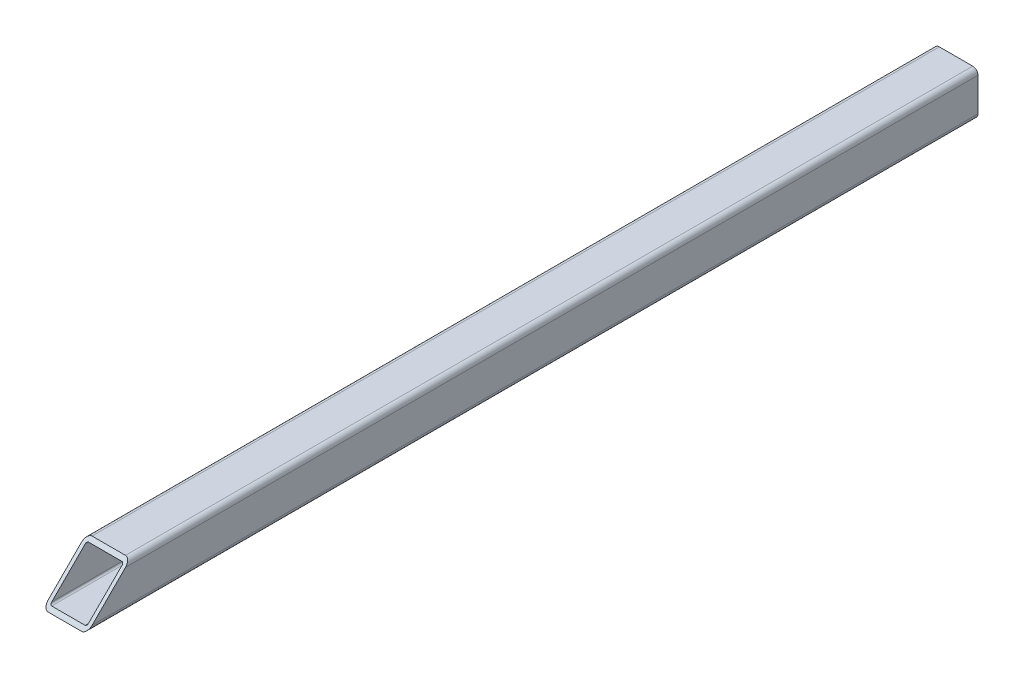
ISO-10303-21;
HEADER;
FILE_DESCRIPTION(('STEP AP214'),'2;1');
FILE_NAME('part.step','',(''),(''),'','','');
FILE_SCHEMA(('AUTOMOTIVE_DESIGN { 1 0 10303 214 1 1 1 1 }'));
ENDSEC;
DATA;
#1=APPLICATION_CONTEXT('core data for automotive mechanical design processes');
#2=APPLICATION_PROTOCOL_DEFINITION('international standard','automotive_design',2000,#1);
#3=PRODUCT_CONTEXT('',#1,'mechanical');
#4=PRODUCT('Part','Part','',(#3));
#5=PRODUCT_RELATED_PRODUCT_CATEGORY('part','',(#4));
#6=PRODUCT_DEFINITION_FORMATION('','',#4);
#7=PRODUCT_DEFINITION_CONTEXT('part definition',#1,'design');
#8=PRODUCT_DEFINITION('design','',#6,#7);
#9=PRODUCT_DEFINITION_SHAPE('','',#8);
#10=(LENGTH_UNIT() NAMED_UNIT(*) SI_UNIT(.MILLI.,.METRE.));
#11=(NAMED_UNIT(*) PLANE_ANGLE_UNIT() SI_UNIT($,.RADIAN.));
#12=(NAMED_UNIT(*) SI_UNIT($,.STERADIAN.) SOLID_ANGLE_UNIT());
#13=UNCERTAINTY_MEASURE_WITH_UNIT(LENGTH_MEASURE(1.E-05),#10,'distance_accuracy_value','');
#14=(GEOMETRIC_REPRESENTATION_CONTEXT(3) GLOBAL_UNCERTAINTY_ASSIGNED_CONTEXT((#13)) GLOBAL_UNIT_ASSIGNED_CONTEXT((#10,
#11,#12)) REPRESENTATION_CONTEXT('',''));
#15=CARTESIAN_POINT('',(0.,0.,0.));
#16=DIRECTION('',(0.,0.,1.));
#17=DIRECTION('',(1.,0.,0.));
#18=AXIS2_PLACEMENT_3D('',#15,#16,#17);
#19=CARTESIAN_POINT('',(0.,0.,0.));
#20=DIRECTION('',(0.,0.,1.));
#21=DIRECTION('',(1.,0.,0.));
#22=AXIS2_PLACEMENT_3D('',#19,#20,#21);
#23=PLANE('',#22);
#24=DIRECTION('',(0.,1.,0.));
#25=VECTOR('',#24,1.);
#26=CARTESIAN_POINT('',(-12.5,-4.75,0.));
#27=LINE('',#26,#25);
#28=CARTESIAN_POINT('',(-12.5,-9.5,0.));
#29=VERTEX_POINT('',#28);
#30=CARTESIAN_POINT('',(-12.5,9.5,0.));
#31=VERTEX_POINT('',#30);
#32=EDGE_CURVE('E131',#29,#31,#27,.T.);
#33=ORIENTED_EDGE('',*,*,#32,.T.);
#34=CARTESIAN_POINT('',(-9.5,9.5,0.));
#35=DIRECTION('',(0.,0.,-1.));
#36=DIRECTION('',(0.,-1.,0.));
#37=AXIS2_PLACEMENT_3D('',#34,#35,#36);
#38=CIRCLE('',#37,3.);
#39=CARTESIAN_POINT('',(-9.5,12.5,0.));
#40=VERTEX_POINT('',#39);
#41=EDGE_CURVE('E190',#31,#40,#38,.T.);
#42=ORIENTED_EDGE('',*,*,#41,.T.);
#43=DIRECTION('',(1.,0.,0.));
#44=VECTOR('',#43,1.);
#45=CARTESIAN_POINT('',(-4.75,12.5,0.));
#46=LINE('',#45,#44);
#47=CARTESIAN_POINT('',(9.5,12.5,0.));
#48=VERTEX_POINT('',#47);
#49=EDGE_CURVE('E97',#40,#48,#46,.T.);
#50=ORIENTED_EDGE('',*,*,#49,.T.);
#51=CARTESIAN_POINT('',(9.5,9.5,0.));
#52=DIRECTION('',(0.,0.,-1.));
#53=DIRECTION('',(-1.,0.,0.));
#54=AXIS2_PLACEMENT_3D('',#51,#52,#53);
#55=CIRCLE('',#54,3.);
#56=CARTESIAN_POINT('',(12.5,9.5,0.));
#57=VERTEX_POINT('',#56);
#58=EDGE_CURVE('E92',#48,#57,#55,.T.);
#59=ORIENTED_EDGE('',*,*,#58,.T.);
#60=DIRECTION('',(0.,-1.,0.));
#61=VECTOR('',#60,1.);
#62=CARTESIAN_POINT('',(12.5,4.75,0.));
#63=LINE('',#62,#61);
#64=CARTESIAN_POINT('',(12.5,-9.5,0.));
#65=VERTEX_POINT('',#64);
#66=EDGE_CURVE('E76',#57,#65,#63,.T.);
#67=ORIENTED_EDGE('',*,*,#66,.T.);
#68=CARTESIAN_POINT('',(9.5,-9.5,0.));
#69=DIRECTION('',(0.,0.,-1.));
#70=DIRECTION('',(0.,1.,0.));
#71=AXIS2_PLACEMENT_3D('',#68,#69,#70);
#72=CIRCLE('',#71,3.);
#73=CARTESIAN_POINT('',(9.5,-12.5,0.));
#74=VERTEX_POINT('',#73);
#75=EDGE_CURVE('E234',#65,#74,#72,.T.);
#76=ORIENTED_EDGE('',*,*,#75,.T.);
#77=DIRECTION('',(-1.,0.,0.));
#78=VECTOR('',#77,1.);
#79=CARTESIAN_POINT('',(4.75,-12.5,0.));
#80=LINE('',#79,#78);
#81=CARTESIAN_POINT('',(-9.5,-12.5,0.));
#82=VERTEX_POINT('',#81);
#83=EDGE_CURVE('E27',#74,#82,#80,.T.);
#84=ORIENTED_EDGE('',*,*,#83,.T.);
#85=CARTESIAN_POINT('',(-9.5,-9.5,0.));
#86=DIRECTION('',(0.,0.,-1.));
#87=DIRECTION('',(1.,0.,0.));
#88=AXIS2_PLACEMENT_3D('',#85,#86,#87);
#89=CIRCLE('',#88,3.);
#90=EDGE_CURVE('E11',#82,#29,#89,.T.);
#91=ORIENTED_EDGE('',*,*,#90,.T.);
#92=EDGE_LOOP('',(#33,#42,#50,#59,#67,#76,#84,#91));
#93=FACE_BOUND('',#92,.T.);
#94=DIRECTION('',(-1.,0.,0.));
#95=VECTOR('',#94,1.);
#96=CARTESIAN_POINT('',(-4.75,10.5,0.));
#97=LINE('',#96,#95);
#98=CARTESIAN_POINT('',(9.5,10.5,0.));
#99=VERTEX_POINT('',#98);
#100=CARTESIAN_POINT('',(-9.5,10.5,0.));
#101=VERTEX_POINT('',#100);
#102=EDGE_CURVE('E203',#99,#101,#97,.T.);
#103=ORIENTED_EDGE('',*,*,#102,.T.);
#104=CARTESIAN_POINT('',(-9.5,9.5,0.));
#105=DIRECTION('',(0.,0.,1.));
#106=DIRECTION('',(0.,-1.,0.));
#107=AXIS2_PLACEMENT_3D('',#104,#105,#106);
#108=CIRCLE('',#107,1.);
#109=CARTESIAN_POINT('',(-10.5,9.5,0.));
#110=VERTEX_POINT('',#109);
#111=EDGE_CURVE('E174',#101,#110,#108,.T.);
#112=ORIENTED_EDGE('',*,*,#111,.T.);
#113=DIRECTION('',(0.,-1.,0.));
#114=VECTOR('',#113,1.);
#115=CARTESIAN_POINT('',(-10.5,-4.75,0.));
#116=LINE('',#115,#114);
#117=CARTESIAN_POINT('',(-10.5,-9.5,0.));
#118=VERTEX_POINT('',#117);
#119=EDGE_CURVE('E158',#110,#118,#116,.T.);
#120=ORIENTED_EDGE('',*,*,#119,.T.);
#121=CARTESIAN_POINT('',(-9.5,-9.5,0.));
#122=DIRECTION('',(0.,0.,1.));
#123=DIRECTION('',(1.,0.,0.));
#124=AXIS2_PLACEMENT_3D('',#121,#122,#123);
#125=CIRCLE('',#124,1.);
#126=CARTESIAN_POINT('',(-9.5,-10.5,0.));
#127=VERTEX_POINT('',#126);
#128=EDGE_CURVE('E137',#118,#127,#125,.T.);
#129=ORIENTED_EDGE('',*,*,#128,.T.);
#130=DIRECTION('',(1.,0.,0.));
#131=VECTOR('',#130,1.);
#132=CARTESIAN_POINT('',(4.75,-10.5,0.));
#133=LINE('',#132,#131);
#134=CARTESIAN_POINT('',(9.5,-10.5,0.));
#135=VERTEX_POINT('',#134);
#136=EDGE_CURVE('E167',#127,#135,#133,.T.);
#137=ORIENTED_EDGE('',*,*,#136,.T.);
#138=CARTESIAN_POINT('',(9.5,-9.5,0.));
#139=DIRECTION('',(0.,0.,1.));
#140=DIRECTION('',(0.,1.,0.));
#141=AXIS2_PLACEMENT_3D('',#138,#139,#140);
#142=CIRCLE('',#141,1.);
#143=CARTESIAN_POINT('',(10.5,-9.5,0.));
#144=VERTEX_POINT('',#143);
#145=EDGE_CURVE('E166',#135,#144,#142,.T.);
#146=ORIENTED_EDGE('',*,*,#145,.T.);
#147=DIRECTION('',(0.,1.,0.));
#148=VECTOR('',#147,1.);
#149=CARTESIAN_POINT('',(10.5,4.75,0.));
#150=LINE('',#149,#148);
#151=CARTESIAN_POINT('',(10.5,9.5,0.));
#152=VERTEX_POINT('',#151);
#153=EDGE_CURVE('E317',#144,#152,#150,.T.);
#154=ORIENTED_EDGE('',*,*,#153,.T.);
#155=CARTESIAN_POINT('',(9.5,9.5,0.));
#156=DIRECTION('',(0.,0.,1.));
#157=DIRECTION('',(-1.,0.,0.));
#158=AXIS2_PLACEMENT_3D('',#155,#156,#157);
#159=CIRCLE('',#158,1.);
#160=EDGE_CURVE('E210',#152,#99,#159,.T.);
#161=ORIENTED_EDGE('',*,*,#160,.T.);
#162=EDGE_LOOP('',(#103,#112,#120,#129,#137,#146,#154,#161));
#163=FACE_BOUND('',#162,.T.);
#164=ADVANCED_FACE('F16',(#93,#163),#23,.F.);
#165=CARTESIAN_POINT('',(-9.5,-9.5,0.));
#166=DIRECTION('',(0.,0.,1.));
#167=DIRECTION('',(1.,0.,0.));
#168=AXIS2_PLACEMENT_3D('',#165,#166,#167);
#169=CYLINDRICAL_SURFACE('',#168,3.);
#170=CARTESIAN_POINT('',(-9.5,-9.5,504.5));
#171=DIRECTION('',(0.,-0.707106781186548,-0.707106781186548));
#172=DIRECTION('',(0.,0.707106781186548,-0.707106781186548));
#173=AXIS2_PLACEMENT_3D('',#170,#171,#172);
#174=ELLIPSE('',#173,4.24264068711929,3.);
#175=CARTESIAN_POINT('',(-9.5,-12.5,507.5000001));
#176=VERTEX_POINT('',#175);
#177=CARTESIAN_POINT('',(-12.5,-9.5,504.5));
#178=VERTEX_POINT('',#177);
#179=EDGE_CURVE('E187',#176,#178,#174,.T.);
#180=ORIENTED_EDGE('',*,*,#179,.T.);
#181=DIRECTION('',(0.,0.,1.));
#182=VECTOR('',#181,1.);
#183=CARTESIAN_POINT('',(-12.5,-9.5,0.));
#184=LINE('',#183,#182);
#185=EDGE_CURVE('E20',#29,#178,#184,.T.);
#186=ORIENTED_EDGE('',*,*,#185,.F.);
#187=ORIENTED_EDGE('',*,*,#90,.F.);
#188=DIRECTION('',(0.,0.,1.));
#189=VECTOR('',#188,1.);
#190=CARTESIAN_POINT('',(-9.5,-12.5,0.));
#191=LINE('',#190,#189);
#192=EDGE_CURVE('E359',#82,#176,#191,.T.);
#193=ORIENTED_EDGE('',*,*,#192,.T.);
#194=EDGE_LOOP('',(#180,#186,#187,#193));
#195=FACE_BOUND('',#194,.T.);
#196=ADVANCED_FACE('F392',(#195),#169,.T.);
#197=CARTESIAN_POINT('',(9.5,-12.5,0.));
#198=DIRECTION('',(0.,-1.,0.));
#199=DIRECTION('',(0.,0.,-1.));
#200=AXIS2_PLACEMENT_3D('',#197,#198,#199);
#201=PLANE('',#200);
#202=DIRECTION('',(-1.,0.,0.));
#203=VECTOR('',#202,1.);
#204=CARTESIAN_POINT('',(4.75,-12.5,507.5000001));
#205=LINE('',#204,#203);
#206=CARTESIAN_POINT('',(9.5,-12.5,507.5000001));
#207=VERTEX_POINT('',#206);
#208=EDGE_CURVE('E117',#207,#176,#205,.T.);
#209=ORIENTED_EDGE('',*,*,#208,.T.);
#210=ORIENTED_EDGE('',*,*,#192,.F.);
#211=ORIENTED_EDGE('',*,*,#83,.F.);
#212=DIRECTION('',(0.,0.,1.));
#213=VECTOR('',#212,1.);
#214=CARTESIAN_POINT('',(9.5,-12.5,0.));
#215=LINE('',#214,#213);
#216=EDGE_CURVE('E89',#74,#207,#215,.T.);
#217=ORIENTED_EDGE('',*,*,#216,.T.);
#218=EDGE_LOOP('',(#209,#210,#211,#217));
#219=FACE_BOUND('',#218,.T.);
#220=ADVANCED_FACE('F388',(#219),#201,.T.);
#221=CARTESIAN_POINT('',(9.5,-9.5,0.));
#222=DIRECTION('',(0.,0.,1.));
#223=DIRECTION('',(0.,1.,0.));
#224=AXIS2_PLACEMENT_3D('',#221,#222,#223);
#225=CYLINDRICAL_SURFACE('',#224,3.);
#226=CARTESIAN_POINT('',(9.5,-9.5,504.5));
#227=DIRECTION('',(0.,-0.707106781186548,-0.707106781186548));
#228=DIRECTION('',(0.,0.707106781186548,-0.707106781186548));
#229=AXIS2_PLACEMENT_3D('',#226,#227,#228);
#230=ELLIPSE('',#229,4.24264068711929,3.);
#231=CARTESIAN_POINT('',(12.5,-9.5,504.5));
#232=VERTEX_POINT('',#231);
#233=EDGE_CURVE('E220',#232,#207,#230,.T.);
#234=ORIENTED_EDGE('',*,*,#233,.T.);
#235=ORIENTED_EDGE('',*,*,#216,.F.);
#236=ORIENTED_EDGE('',*,*,#75,.F.);
#237=DIRECTION('',(0.,0.,1.));
#238=VECTOR('',#237,1.);
#239=CARTESIAN_POINT('',(12.5,-9.5,0.));
#240=LINE('',#239,#238);
#241=EDGE_CURVE('E85',#65,#232,#240,.T.);
#242=ORIENTED_EDGE('',*,*,#241,.T.);
#243=EDGE_LOOP('',(#234,#235,#236,#242));
#244=FACE_BOUND('',#243,.T.);
#245=ADVANCED_FACE('F18',(#244),#225,.T.);
#246=CARTESIAN_POINT('',(12.5,9.5,0.));
#247=DIRECTION('',(1.,0.,0.));
#248=DIRECTION('',(0.,1.,0.));
#249=AXIS2_PLACEMENT_3D('',#246,#247,#248);
#250=PLANE('',#249);
#251=DIRECTION('',(0.,-0.707106781186547,0.707106781186548));
#252=VECTOR('',#251,1.);
#253=CARTESIAN_POINT('',(12.5,249.875,245.125));
#254=LINE('',#253,#252);
#255=CARTESIAN_POINT('',(12.5,9.5,485.5));
#256=VERTEX_POINT('',#255);
#257=EDGE_CURVE('E230',#256,#232,#254,.T.);
#258=ORIENTED_EDGE('',*,*,#257,.T.);
#259=ORIENTED_EDGE('',*,*,#241,.F.);
#260=ORIENTED_EDGE('',*,*,#66,.F.);
#261=DIRECTION('',(0.,0.,1.));
#262=VECTOR('',#261,1.);
#263=CARTESIAN_POINT('',(12.5,9.5,0.));
#264=LINE('',#263,#262);
#265=EDGE_CURVE('E82',#57,#256,#264,.T.);
#266=ORIENTED_EDGE('',*,*,#265,.T.);
#267=EDGE_LOOP('',(#258,#259,#260,#266));
#268=FACE_BOUND('',#267,.T.);
#269=ADVANCED_FACE('F79',(#268),#250,.T.);
#270=CARTESIAN_POINT('',(9.5,9.5,0.));
#271=DIRECTION('',(0.,0.,1.));
#272=DIRECTION('',(-1.,0.,0.));
#273=AXIS2_PLACEMENT_3D('',#270,#271,#272);
#274=CYLINDRICAL_SURFACE('',#273,1.);
#275=CARTESIAN_POINT('',(9.5,9.5,485.5));
#276=DIRECTION('',(0.,0.707106781186548,0.707106781186547));
#277=DIRECTION('',(0.,-0.707106781186547,0.707106781186548));
#278=AXIS2_PLACEMENT_3D('',#275,#276,#277);
#279=ELLIPSE('',#278,1.4142135623731,1.);
#280=CARTESIAN_POINT('',(10.5,9.5,485.5));
#281=VERTEX_POINT('',#280);
#282=CARTESIAN_POINT('',(9.5,10.5,484.5));
#283=VERTEX_POINT('',#282);
#284=EDGE_CURVE('E183',#281,#283,#279,.T.);
#285=ORIENTED_EDGE('',*,*,#284,.T.);
#286=DIRECTION('',(0.,0.,1.));
#287=VECTOR('',#286,1.);
#288=CARTESIAN_POINT('',(9.5,10.5,0.));
#289=LINE('',#288,#287);
#290=EDGE_CURVE('E178',#99,#283,#289,.T.);
#291=ORIENTED_EDGE('',*,*,#290,.F.);
#292=ORIENTED_EDGE('',*,*,#160,.F.);
#293=DIRECTION('',(0.,0.,1.));
#294=VECTOR('',#293,1.);
#295=CARTESIAN_POINT('',(10.5,9.5,0.));
#296=LINE('',#295,#294);
#297=EDGE_CURVE('E197',#152,#281,#296,.T.);
#298=ORIENTED_EDGE('',*,*,#297,.T.);
#299=EDGE_LOOP('',(#285,#291,#292,#298));
#300=FACE_BOUND('',#299,.T.);
#301=ADVANCED_FACE('F491',(#300),#274,.F.);
#302=CARTESIAN_POINT('',(10.5,9.5,0.));
#303=DIRECTION('',(1.,0.,0.));
#304=DIRECTION('',(0.,-1.,0.));
#305=AXIS2_PLACEMENT_3D('',#302,#303,#304);
#306=PLANE('',#305);
#307=DIRECTION('',(0.,0.707106781186547,-0.707106781186548));
#308=VECTOR('',#307,1.);
#309=CARTESIAN_POINT('',(10.5,249.875,245.125));
#310=LINE('',#309,#308);
#311=CARTESIAN_POINT('',(10.5,-9.5,504.5));
#312=VERTEX_POINT('',#311);
#313=EDGE_CURVE('E198',#312,#281,#310,.T.);
#314=ORIENTED_EDGE('',*,*,#313,.T.);
#315=ORIENTED_EDGE('',*,*,#297,.F.);
#316=ORIENTED_EDGE('',*,*,#153,.F.);
#317=DIRECTION('',(0.,0.,1.));
#318=VECTOR('',#317,1.);
#319=CARTESIAN_POINT('',(10.5,-9.5,0.));
#320=LINE('',#319,#318);
#321=EDGE_CURVE('E163',#144,#312,#320,.T.);
#322=ORIENTED_EDGE('',*,*,#321,.T.);
#323=EDGE_LOOP('',(#314,#315,#316,#322));
#324=FACE_BOUND('',#323,.T.);
#325=ADVANCED_FACE('F318',(#324),#306,.F.);
#326=CARTESIAN_POINT('',(9.5,-9.5,0.));
#327=DIRECTION('',(0.,0.,1.));
#328=DIRECTION('',(0.,1.,0.));
#329=AXIS2_PLACEMENT_3D('',#326,#327,#328);
#330=CYLINDRICAL_SURFACE('',#329,1.);
#331=CARTESIAN_POINT('',(9.5,-9.5,504.5));
#332=DIRECTION('',(0.,0.707106781186548,0.707106781186547));
#333=DIRECTION('',(0.,0.707106781186547,-0.707106781186548));
#334=AXIS2_PLACEMENT_3D('',#331,#332,#333);
#335=ELLIPSE('',#334,1.4142135623731,1.);
#336=CARTESIAN_POINT('',(9.5,-10.5,505.5));
#337=VERTEX_POINT('',#336);
#338=EDGE_CURVE('E202',#337,#312,#335,.T.);
#339=ORIENTED_EDGE('',*,*,#338,.T.);
#340=ORIENTED_EDGE('',*,*,#321,.F.);
#341=ORIENTED_EDGE('',*,*,#145,.F.);
#342=DIRECTION('',(0.,0.,1.));
#343=VECTOR('',#342,1.);
#344=CARTESIAN_POINT('',(9.5,-10.5,0.));
#345=LINE('',#344,#343);
#346=EDGE_CURVE('E102',#135,#337,#345,.T.);
#347=ORIENTED_EDGE('',*,*,#346,.T.);
#348=EDGE_LOOP('',(#339,#340,#341,#347));
#349=FACE_BOUND('',#348,.T.);
#350=ADVANCED_FACE('F326',(#349),#330,.F.);
#351=CARTESIAN_POINT('',(9.5,-10.5,0.));
#352=DIRECTION('',(0.,-1.,0.));
#353=DIRECTION('',(0.,0.,-1.));
#354=AXIS2_PLACEMENT_3D('',#351,#352,#353);
#355=PLANE('',#354);
#356=DIRECTION('',(1.,0.,0.));
#357=VECTOR('',#356,1.);
#358=CARTESIAN_POINT('',(4.75000000000012,-10.5,505.5));
#359=LINE('',#358,#357);
#360=CARTESIAN_POINT('',(-9.5,-10.5,505.5));
#361=VERTEX_POINT('',#360);
#362=EDGE_CURVE('E130',#361,#337,#359,.T.);
#363=ORIENTED_EDGE('',*,*,#362,.T.);
#364=ORIENTED_EDGE('',*,*,#346,.F.);
#365=ORIENTED_EDGE('',*,*,#136,.F.);
#366=DIRECTION('',(0.,0.,1.));
#367=VECTOR('',#366,1.);
#368=CARTESIAN_POINT('',(-9.5,-10.5,0.));
#369=LINE('',#368,#367);
#370=EDGE_CURVE('E147',#127,#361,#369,.T.);
#371=ORIENTED_EDGE('',*,*,#370,.T.);
#372=EDGE_LOOP('',(#363,#364,#365,#371));
#373=FACE_BOUND('',#372,.T.);
#374=ADVANCED_FACE('F523',(#373),#355,.F.);
#375=CARTESIAN_POINT('',(9.5,9.5,0.));
#376=DIRECTION('',(0.,0.,1.));
#377=DIRECTION('',(-1.,0.,0.));
#378=AXIS2_PLACEMENT_3D('',#375,#376,#377);
#379=CYLINDRICAL_SURFACE('',#378,3.);
#380=CARTESIAN_POINT('',(9.5,9.5,485.5));
#381=DIRECTION('',(0.,-0.707106781186548,-0.707106781186548));
#382=DIRECTION('',(0.,-0.707106781186548,0.707106781186548));
#383=AXIS2_PLACEMENT_3D('',#380,#381,#382);
#384=ELLIPSE('',#383,4.24264068711929,3.);
#385=CARTESIAN_POINT('',(9.5,12.5,482.5));
#386=VERTEX_POINT('',#385);
#387=EDGE_CURVE('E105',#386,#256,#384,.T.);
#388=ORIENTED_EDGE('',*,*,#387,.T.);
#389=ORIENTED_EDGE('',*,*,#265,.F.);
#390=ORIENTED_EDGE('',*,*,#58,.F.);
#391=DIRECTION('',(0.,0.,1.));
#392=VECTOR('',#391,1.);
#393=CARTESIAN_POINT('',(9.5,12.5,0.));
#394=LINE('',#393,#392);
#395=EDGE_CURVE('E113',#48,#386,#394,.T.);
#396=ORIENTED_EDGE('',*,*,#395,.T.);
#397=EDGE_LOOP('',(#388,#389,#390,#396));
#398=FACE_BOUND('',#397,.T.);
#399=ADVANCED_FACE('F103',(#398),#379,.T.);
#400=CARTESIAN_POINT('',(-9.5,12.5,0.));
#401=DIRECTION('',(0.,1.,0.));
#402=DIRECTION('',(1.,0.,0.));
#403=AXIS2_PLACEMENT_3D('',#400,#401,#402);
#404=PLANE('',#403);
#405=DIRECTION('',(1.,0.,0.));
#406=VECTOR('',#405,1.);
#407=CARTESIAN_POINT('',(-4.74999999999994,12.5,482.5));
#408=LINE('',#407,#406);
#409=CARTESIAN_POINT('',(-9.5,12.5,482.5));
#410=VERTEX_POINT('',#409);
#411=EDGE_CURVE('E124',#410,#386,#408,.T.);
#412=ORIENTED_EDGE('',*,*,#411,.T.);
#413=ORIENTED_EDGE('',*,*,#395,.F.);
#414=ORIENTED_EDGE('',*,*,#49,.F.);
#415=DIRECTION('',(0.,0.,1.));
#416=VECTOR('',#415,1.);
#417=CARTESIAN_POINT('',(-9.5,12.5,0.));
#418=LINE('',#417,#416);
#419=EDGE_CURVE('E213',#40,#410,#418,.T.);
#420=ORIENTED_EDGE('',*,*,#419,.T.);
#421=EDGE_LOOP('',(#412,#413,#414,#420));
#422=FACE_BOUND('',#421,.T.);
#423=ADVANCED_FACE('F460',(#422),#404,.T.);
#424=CARTESIAN_POINT('',(-9.5,9.5,0.));
#425=DIRECTION('',(0.,0.,1.));
#426=DIRECTION('',(0.,-1.,0.));
#427=AXIS2_PLACEMENT_3D('',#424,#425,#426);
#428=CYLINDRICAL_SURFACE('',#427,3.);
#429=CARTESIAN_POINT('',(-9.5,9.5,485.5));
#430=DIRECTION('',(0.,-0.707106781186548,-0.707106781186548));
#431=DIRECTION('',(0.,-0.707106781186548,0.707106781186548));
#432=AXIS2_PLACEMENT_3D('',#429,#430,#431);
#433=ELLIPSE('',#432,4.24264068711929,3.);
#434=CARTESIAN_POINT('',(-12.5,9.5,485.5));
#435=VERTEX_POINT('',#434);
#436=EDGE_CURVE('E119',#435,#410,#433,.T.);
#437=ORIENTED_EDGE('',*,*,#436,.T.);
#438=ORIENTED_EDGE('',*,*,#419,.F.);
#439=ORIENTED_EDGE('',*,*,#41,.F.);
#440=DIRECTION('',(0.,0.,1.));
#441=VECTOR('',#440,1.);
#442=CARTESIAN_POINT('',(-12.5,9.5,0.));
#443=LINE('',#442,#441);
#444=EDGE_CURVE('E134',#31,#435,#443,.T.);
#445=ORIENTED_EDGE('',*,*,#444,.T.);
#446=EDGE_LOOP('',(#437,#438,#439,#445));
#447=FACE_BOUND('',#446,.T.);
#448=ADVANCED_FACE('F397',(#447),#428,.T.);
#449=CARTESIAN_POINT('',(-12.5,-9.5,0.));
#450=DIRECTION('',(-1.,0.,0.));
#451=DIRECTION('',(0.,1.,0.));
#452=AXIS2_PLACEMENT_3D('',#449,#450,#451);
#453=PLANE('',#452);
#454=DIRECTION('',(0.,0.707106781186547,-0.707106781186548));
#455=VECTOR('',#454,1.);
#456=CARTESIAN_POINT('',(-12.5,245.125,249.875));
#457=LINE('',#456,#455);
#458=EDGE_CURVE('E123',#178,#435,#457,.T.);
#459=ORIENTED_EDGE('',*,*,#458,.T.);
#460=ORIENTED_EDGE('',*,*,#444,.F.);
#461=ORIENTED_EDGE('',*,*,#32,.F.);
#462=ORIENTED_EDGE('',*,*,#185,.T.);
#463=EDGE_LOOP('',(#459,#460,#461,#462));
#464=FACE_BOUND('',#463,.T.);
#465=ADVANCED_FACE('F396',(#464),#453,.T.);
#466=CARTESIAN_POINT('',(-9.5,-9.5,0.));
#467=DIRECTION('',(0.,0.,1.));
#468=DIRECTION('',(1.,0.,0.));
#469=AXIS2_PLACEMENT_3D('',#466,#467,#468);
#470=CYLINDRICAL_SURFACE('',#469,1.);
#471=CARTESIAN_POINT('',(-9.5,-9.5,504.5));
#472=DIRECTION('',(0.,0.707106781186548,0.707106781186547));
#473=DIRECTION('',(0.,0.707106781186547,-0.707106781186548));
#474=AXIS2_PLACEMENT_3D('',#471,#472,#473);
#475=ELLIPSE('',#474,1.4142135623731,1.);
#476=CARTESIAN_POINT('',(-10.5,-9.5,504.5));
#477=VERTEX_POINT('',#476);
#478=EDGE_CURVE('E125',#477,#361,#475,.T.);
#479=ORIENTED_EDGE('',*,*,#478,.T.);
#480=ORIENTED_EDGE('',*,*,#370,.F.);
#481=ORIENTED_EDGE('',*,*,#128,.F.);
#482=DIRECTION('',(0.,0.,1.));
#483=VECTOR('',#482,1.);
#484=CARTESIAN_POINT('',(-10.5,-9.5,0.));
#485=LINE('',#484,#483);
#486=EDGE_CURVE('E171',#118,#477,#485,.T.);
#487=ORIENTED_EDGE('',*,*,#486,.T.);
#488=EDGE_LOOP('',(#479,#480,#481,#487));
#489=FACE_BOUND('',#488,.T.);
#490=ADVANCED_FACE('F262',(#489),#470,.F.);
#491=CARTESIAN_POINT('',(-10.5,-9.5,0.));
#492=DIRECTION('',(-1.,0.,0.));
#493=DIRECTION('',(0.,0.,1.));
#494=AXIS2_PLACEMENT_3D('',#491,#492,#493);
#495=PLANE('',#494);
#496=DIRECTION('',(0.,-0.707106781186547,0.707106781186548));
#497=VECTOR('',#496,1.);
#498=CARTESIAN_POINT('',(-10.5,245.125,249.875));
#499=LINE('',#498,#497);
#500=CARTESIAN_POINT('',(-10.5,9.5,485.5));
#501=VERTEX_POINT('',#500);
#502=EDGE_CURVE('E129',#501,#477,#499,.T.);
#503=ORIENTED_EDGE('',*,*,#502,.T.);
#504=ORIENTED_EDGE('',*,*,#486,.F.);
#505=ORIENTED_EDGE('',*,*,#119,.F.);
#506=DIRECTION('',(0.,0.,1.));
#507=VECTOR('',#506,1.);
#508=CARTESIAN_POINT('',(-10.5,9.5,0.));
#509=LINE('',#508,#507);
#510=EDGE_CURVE('E175',#110,#501,#509,.T.);
#511=ORIENTED_EDGE('',*,*,#510,.T.);
#512=EDGE_LOOP('',(#503,#504,#505,#511));
#513=FACE_BOUND('',#512,.T.);
#514=ADVANCED_FACE('F250',(#513),#495,.F.);
#515=CARTESIAN_POINT('',(-9.5,9.5,0.));
#516=DIRECTION('',(0.,0.,1.));
#517=DIRECTION('',(0.,-1.,0.));
#518=AXIS2_PLACEMENT_3D('',#515,#516,#517);
#519=CYLINDRICAL_SURFACE('',#518,1.);
#520=CARTESIAN_POINT('',(-9.5,9.5,485.5));
#521=DIRECTION('',(0.,0.707106781186548,0.707106781186547));
#522=DIRECTION('',(0.,-0.707106781186547,0.707106781186548));
#523=AXIS2_PLACEMENT_3D('',#520,#521,#522);
#524=ELLIPSE('',#523,1.4142135623731,1.);
#525=CARTESIAN_POINT('',(-9.5,10.5,484.5));
#526=VERTEX_POINT('',#525);
#527=EDGE_CURVE('E184',#526,#501,#524,.T.);
#528=ORIENTED_EDGE('',*,*,#527,.T.);
#529=ORIENTED_EDGE('',*,*,#510,.F.);
#530=ORIENTED_EDGE('',*,*,#111,.F.);
#531=DIRECTION('',(0.,0.,1.));
#532=VECTOR('',#531,1.);
#533=CARTESIAN_POINT('',(-9.5,10.5,0.));
#534=LINE('',#533,#532);
#535=EDGE_CURVE('E207',#101,#526,#534,.T.);
#536=ORIENTED_EDGE('',*,*,#535,.T.);
#537=EDGE_LOOP('',(#528,#529,#530,#536));
#538=FACE_BOUND('',#537,.T.);
#539=ADVANCED_FACE('F482',(#538),#519,.F.);
#540=CARTESIAN_POINT('',(-9.5,10.5,0.));
#541=DIRECTION('',(0.,1.,0.));
#542=DIRECTION('',(1.,0.,0.));
#543=AXIS2_PLACEMENT_3D('',#540,#541,#542);
#544=PLANE('',#543);
#545=DIRECTION('',(-1.,0.,0.));
#546=VECTOR('',#545,1.);
#547=CARTESIAN_POINT('',(-4.74999999999989,10.5,484.5));
#548=LINE('',#547,#546);
#549=EDGE_CURVE('E179',#283,#526,#548,.T.);
#550=ORIENTED_EDGE('',*,*,#549,.T.);
#551=ORIENTED_EDGE('',*,*,#535,.F.);
#552=ORIENTED_EDGE('',*,*,#102,.F.);
#553=ORIENTED_EDGE('',*,*,#290,.T.);
#554=EDGE_LOOP('',(#550,#551,#552,#553));
#555=FACE_BOUND('',#554,.T.);
#556=ADVANCED_FACE('F514',(#555),#544,.F.);
#557=CARTESIAN_POINT('',(0.,247.5,247.5));
#558=DIRECTION('',(0.,-0.707106781186548,-0.707106781186547));
#559=DIRECTION('',(0.,0.707106781186547,-0.707106781186548));
#560=AXIS2_PLACEMENT_3D('',#557,#558,#559);
#561=PLANE('',#560);
#562=ORIENTED_EDGE('',*,*,#257,.F.);
#563=ORIENTED_EDGE('',*,*,#387,.F.);
#564=ORIENTED_EDGE('',*,*,#411,.F.);
#565=ORIENTED_EDGE('',*,*,#436,.F.);
#566=ORIENTED_EDGE('',*,*,#458,.F.);
#567=ORIENTED_EDGE('',*,*,#179,.F.);
#568=ORIENTED_EDGE('',*,*,#208,.F.);
#569=ORIENTED_EDGE('',*,*,#233,.F.);
#570=EDGE_LOOP('',(#562,#563,#564,#565,#566,#567,#568,#569));
#571=FACE_BOUND('',#570,.T.);
#572=ORIENTED_EDGE('',*,*,#362,.F.);
#573=ORIENTED_EDGE('',*,*,#478,.F.);
#574=ORIENTED_EDGE('',*,*,#502,.F.);
#575=ORIENTED_EDGE('',*,*,#527,.F.);
#576=ORIENTED_EDGE('',*,*,#549,.F.);
#577=ORIENTED_EDGE('',*,*,#284,.F.);
#578=ORIENTED_EDGE('',*,*,#313,.F.);
#579=ORIENTED_EDGE('',*,*,#338,.F.);
#580=EDGE_LOOP('',(#572,#573,#574,#575,#576,#577,#578,#579));
#581=FACE_BOUND('',#580,.T.);
#582=ADVANCED_FACE('F257',(#571,#581),#561,.F.);
#583=CLOSED_SHELL('',(#164,#196,#220,#245,#269,#301,#325,#350,#374,#399,#423,#448,#465,#490,
#514,#539,#556,#582));
#584=MANIFOLD_SOLID_BREP('B1',#583);
#585=ADVANCED_BREP_SHAPE_REPRESENTATION('',(#18,#584),#14);
#586=SHAPE_DEFINITION_REPRESENTATION(#9,#585);
ENDSEC;
END-ISO-10303-21;
